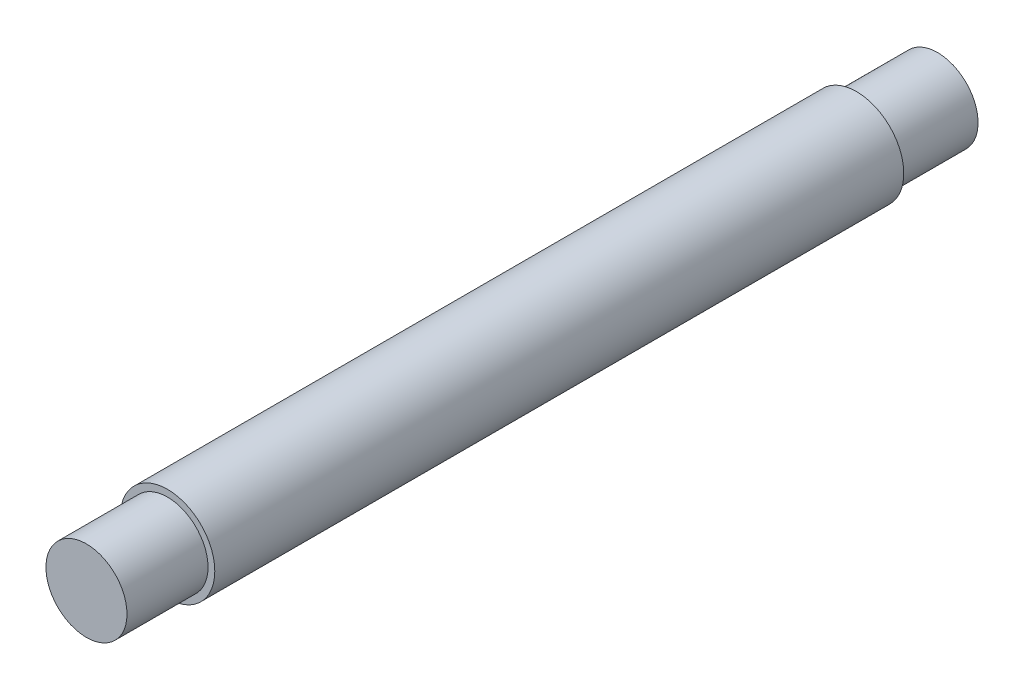
ISO-10303-21;
HEADER;
FILE_DESCRIPTION(('STEP AP214'),'2;1');
FILE_NAME('part.step','',(''),(''),'','','');
FILE_SCHEMA(('AUTOMOTIVE_DESIGN { 1 0 10303 214 1 1 1 1 }'));
ENDSEC;
DATA;
#1=APPLICATION_CONTEXT('core data for automotive mechanical design processes');
#2=APPLICATION_PROTOCOL_DEFINITION('international standard','automotive_design',2000,#1);
#3=PRODUCT_CONTEXT('',#1,'mechanical');
#4=PRODUCT('Part','Part','',(#3));
#5=PRODUCT_RELATED_PRODUCT_CATEGORY('part','',(#4));
#6=PRODUCT_DEFINITION_FORMATION('','',#4);
#7=PRODUCT_DEFINITION_CONTEXT('part definition',#1,'design');
#8=PRODUCT_DEFINITION('design','',#6,#7);
#9=PRODUCT_DEFINITION_SHAPE('','',#8);
#10=(LENGTH_UNIT() NAMED_UNIT(*) SI_UNIT(.MILLI.,.METRE.));
#11=(NAMED_UNIT(*) PLANE_ANGLE_UNIT() SI_UNIT($,.RADIAN.));
#12=(NAMED_UNIT(*) SI_UNIT($,.STERADIAN.) SOLID_ANGLE_UNIT());
#13=UNCERTAINTY_MEASURE_WITH_UNIT(LENGTH_MEASURE(1.E-05),#10,'distance_accuracy_value','');
#14=(GEOMETRIC_REPRESENTATION_CONTEXT(3) GLOBAL_UNCERTAINTY_ASSIGNED_CONTEXT((#13)) GLOBAL_UNIT_ASSIGNED_CONTEXT((#10,
#11,#12)) REPRESENTATION_CONTEXT('',''));
#15=CARTESIAN_POINT('',(0.,0.,0.));
#16=DIRECTION('',(0.,0.,1.));
#17=DIRECTION('',(1.,0.,0.));
#18=AXIS2_PLACEMENT_3D('',#15,#16,#17);
#19=CARTESIAN_POINT('',(0.,0.,63.));
#20=DIRECTION('',(0.,0.,-1.));
#21=DIRECTION('',(-1.,0.,0.));
#22=AXIS2_PLACEMENT_3D('',#19,#20,#21);
#23=CYLINDRICAL_SURFACE('',#22,3.5);
#24=CARTESIAN_POINT('',(0.,0.,57.));
#25=DIRECTION('',(0.,0.,1.));
#26=DIRECTION('',(1.,0.,0.));
#27=AXIS2_PLACEMENT_3D('',#24,#25,#26);
#28=CIRCLE('',#27,3.5);
#29=CARTESIAN_POINT('',(3.5,0.,57.));
#30=VERTEX_POINT('',#29);
#31=EDGE_CURVE('E11',#30,#30,#28,.T.);
#32=ORIENTED_EDGE('',*,*,#31,.F.);
#33=EDGE_LOOP('',(#32));
#34=FACE_BOUND('',#33,.T.);
#35=CARTESIAN_POINT('',(0.,0.,6.));
#36=DIRECTION('',(0.,0.,-1.));
#37=DIRECTION('',(-1.,0.,0.));
#38=AXIS2_PLACEMENT_3D('',#35,#36,#37);
#39=CIRCLE('',#38,3.5);
#40=CARTESIAN_POINT('',(-3.5,0.,6.));
#41=VERTEX_POINT('',#40);
#42=EDGE_CURVE('E46',#41,#41,#39,.T.);
#43=ORIENTED_EDGE('',*,*,#42,.F.);
#44=EDGE_LOOP('',(#43));
#45=FACE_BOUND('',#44,.T.);
#46=ADVANCED_FACE('F43',(#34,#45),#23,.T.);
#47=CARTESIAN_POINT('',(0.,0.,57.));
#48=DIRECTION('',(0.,0.,1.));
#49=DIRECTION('',(1.,0.,0.));
#50=AXIS2_PLACEMENT_3D('',#47,#48,#49);
#51=PLANE('',#50);
#52=CARTESIAN_POINT('',(0.,0.,57.));
#53=DIRECTION('',(0.,0.,1.));
#54=DIRECTION('',(1.,0.,0.));
#55=AXIS2_PLACEMENT_3D('',#52,#53,#54);
#56=CIRCLE('',#55,3.);
#57=CARTESIAN_POINT('',(3.,0.,57.));
#58=VERTEX_POINT('',#57);
#59=EDGE_CURVE('E51',#58,#58,#56,.T.);
#60=ORIENTED_EDGE('',*,*,#59,.F.);
#61=EDGE_LOOP('',(#60));
#62=FACE_BOUND('',#61,.T.);
#63=ORIENTED_EDGE('',*,*,#31,.T.);
#64=EDGE_LOOP('',(#63));
#65=FACE_BOUND('',#64,.T.);
#66=ADVANCED_FACE('F78',(#62,#65),#51,.T.);
#67=CARTESIAN_POINT('',(0.,0.,57.));
#68=DIRECTION('',(0.,0.,1.));
#69=DIRECTION('',(1.,0.,0.));
#70=AXIS2_PLACEMENT_3D('',#67,#68,#69);
#71=CYLINDRICAL_SURFACE('',#70,3.);
#72=ORIENTED_EDGE('',*,*,#59,.T.);
#73=EDGE_LOOP('',(#72));
#74=FACE_BOUND('',#73,.T.);
#75=CARTESIAN_POINT('',(0.,0.,63.));
#76=DIRECTION('',(0.,0.,1.));
#77=DIRECTION('',(1.,0.,0.));
#78=AXIS2_PLACEMENT_3D('',#75,#76,#77);
#79=CIRCLE('',#78,3.);
#80=CARTESIAN_POINT('',(3.,0.,63.));
#81=VERTEX_POINT('',#80);
#82=EDGE_CURVE('E56',#81,#81,#79,.T.);
#83=ORIENTED_EDGE('',*,*,#82,.F.);
#84=EDGE_LOOP('',(#83));
#85=FACE_BOUND('',#84,.T.);
#86=ADVANCED_FACE('F83',(#74,#85),#71,.T.);
#87=CARTESIAN_POINT('',(0.,0.,63.));
#88=DIRECTION('',(0.,0.,1.));
#89=DIRECTION('',(1.,0.,0.));
#90=AXIS2_PLACEMENT_3D('',#87,#88,#89);
#91=PLANE('',#90);
#92=ORIENTED_EDGE('',*,*,#82,.T.);
#93=EDGE_LOOP('',(#92));
#94=FACE_BOUND('',#93,.T.);
#95=ADVANCED_FACE('F89',(#94),#91,.T.);
#96=CARTESIAN_POINT('',(0.,0.,6.));
#97=DIRECTION('',(0.,0.,-1.));
#98=DIRECTION('',(-1.,0.,0.));
#99=AXIS2_PLACEMENT_3D('',#96,#97,#98);
#100=PLANE('',#99);
#101=CARTESIAN_POINT('',(0.,0.,6.));
#102=DIRECTION('',(0.,0.,-1.));
#103=DIRECTION('',(-1.,0.,0.));
#104=AXIS2_PLACEMENT_3D('',#101,#102,#103);
#105=CIRCLE('',#104,3.);
#106=CARTESIAN_POINT('',(-3.,0.,6.));
#107=VERTEX_POINT('',#106);
#108=EDGE_CURVE('E66',#107,#107,#105,.T.);
#109=ORIENTED_EDGE('',*,*,#108,.F.);
#110=EDGE_LOOP('',(#109));
#111=FACE_BOUND('',#110,.T.);
#112=ORIENTED_EDGE('',*,*,#42,.T.);
#113=EDGE_LOOP('',(#112));
#114=FACE_BOUND('',#113,.T.);
#115=ADVANCED_FACE('F75',(#111,#114),#100,.T.);
#116=CARTESIAN_POINT('',(0.,0.,6.));
#117=DIRECTION('',(0.,0.,-1.));
#118=DIRECTION('',(-1.,0.,0.));
#119=AXIS2_PLACEMENT_3D('',#116,#117,#118);
#120=CYLINDRICAL_SURFACE('',#119,3.);
#121=ORIENTED_EDGE('',*,*,#108,.T.);
#122=EDGE_LOOP('',(#121));
#123=FACE_BOUND('',#122,.T.);
#124=CARTESIAN_POINT('',(0.,0.,0.));
#125=DIRECTION('',(0.,0.,-1.));
#126=DIRECTION('',(-1.,0.,0.));
#127=AXIS2_PLACEMENT_3D('',#124,#125,#126);
#128=CIRCLE('',#127,3.);
#129=CARTESIAN_POINT('',(-3.,0.,0.));
#130=VERTEX_POINT('',#129);
#131=EDGE_CURVE('E62',#130,#130,#128,.T.);
#132=ORIENTED_EDGE('',*,*,#131,.F.);
#133=EDGE_LOOP('',(#132));
#134=FACE_BOUND('',#133,.T.);
#135=ADVANCED_FACE('F99',(#123,#134),#120,.T.);
#136=CARTESIAN_POINT('',(0.,0.,0.));
#137=DIRECTION('',(0.,0.,1.));
#138=DIRECTION('',(1.,0.,0.));
#139=AXIS2_PLACEMENT_3D('',#136,#137,#138);
#140=PLANE('',#139);
#141=ORIENTED_EDGE('',*,*,#131,.T.);
#142=EDGE_LOOP('',(#141));
#143=FACE_BOUND('',#142,.T.);
#144=ADVANCED_FACE('F97',(#143),#140,.F.);
#145=CLOSED_SHELL('',(#46,#66,#86,#95,#115,#135,#144));
#146=MANIFOLD_SOLID_BREP('B2',#145);
#147=ADVANCED_BREP_SHAPE_REPRESENTATION('',(#18,#146),#14);
#148=SHAPE_DEFINITION_REPRESENTATION(#9,#147);
ENDSEC;
END-ISO-10303-21;
